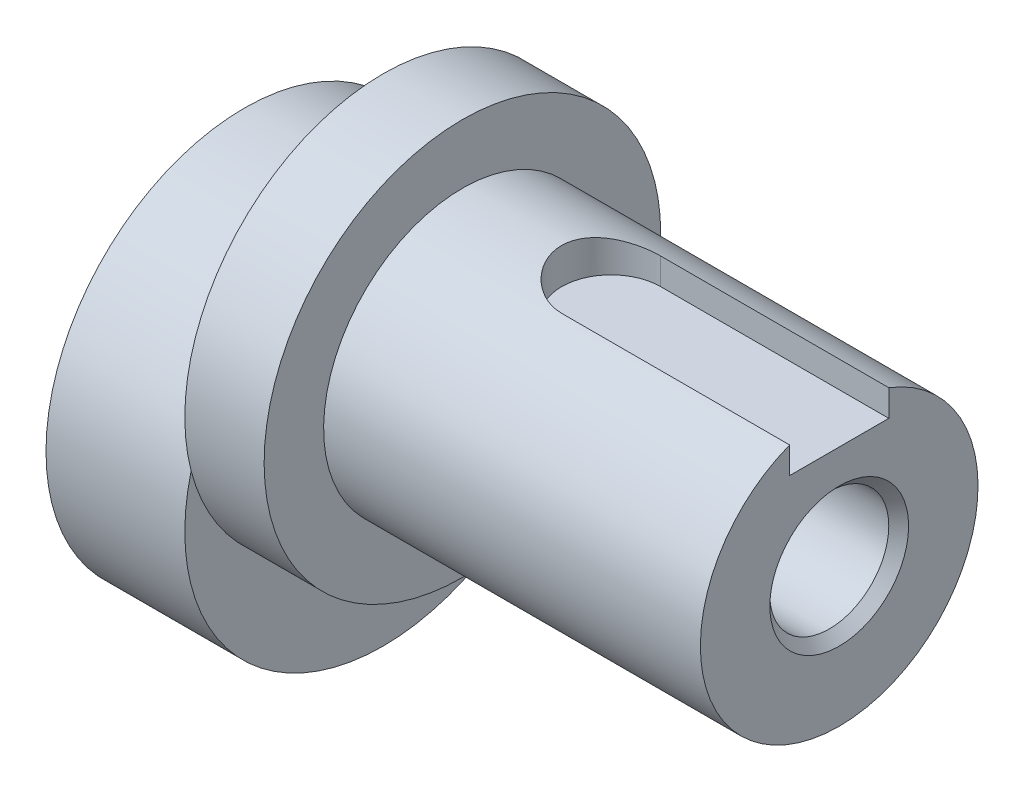
ISO-10303-21;
HEADER;
FILE_DESCRIPTION(('STEP AP214'),'2;1');
FILE_NAME('part.step','',(''),(''),'','','');
FILE_SCHEMA(('AUTOMOTIVE_DESIGN { 1 0 10303 214 1 1 1 1 }'));
ENDSEC;
DATA;
#1=APPLICATION_CONTEXT('core data for automotive mechanical design processes');
#2=APPLICATION_PROTOCOL_DEFINITION('international standard','automotive_design',2000,#1);
#3=PRODUCT_CONTEXT('',#1,'mechanical');
#4=PRODUCT('Part','Part','',(#3));
#5=PRODUCT_RELATED_PRODUCT_CATEGORY('part','',(#4));
#6=PRODUCT_DEFINITION_FORMATION('','',#4);
#7=PRODUCT_DEFINITION_CONTEXT('part definition',#1,'design');
#8=PRODUCT_DEFINITION('design','',#6,#7);
#9=PRODUCT_DEFINITION_SHAPE('','',#8);
#10=(LENGTH_UNIT() NAMED_UNIT(*) SI_UNIT(.MILLI.,.METRE.));
#11=(NAMED_UNIT(*) PLANE_ANGLE_UNIT() SI_UNIT($,.RADIAN.));
#12=(NAMED_UNIT(*) SI_UNIT($,.STERADIAN.) SOLID_ANGLE_UNIT());
#13=UNCERTAINTY_MEASURE_WITH_UNIT(LENGTH_MEASURE(1.E-05),#10,'distance_accuracy_value','');
#14=(GEOMETRIC_REPRESENTATION_CONTEXT(3) GLOBAL_UNCERTAINTY_ASSIGNED_CONTEXT((#13)) GLOBAL_UNIT_ASSIGNED_CONTEXT((#10,
#11,#12)) REPRESENTATION_CONTEXT('',''));
#15=CARTESIAN_POINT('',(0.,0.,0.));
#16=DIRECTION('',(0.,0.,1.));
#17=DIRECTION('',(1.,0.,0.));
#18=AXIS2_PLACEMENT_3D('',#15,#16,#17);
#19=CARTESIAN_POINT('',(30.,5.,0.));
#20=DIRECTION('',(-1.,0.,0.));
#21=DIRECTION('',(0.,0.,1.));
#22=AXIS2_PLACEMENT_3D('',#19,#20,#21);
#23=CYLINDRICAL_SURFACE('',#22,7.);
#24=CARTESIAN_POINT('',(11.,5.,0.));
#25=DIRECTION('',(1.,0.,0.));
#26=DIRECTION('',(0.,0.,-1.));
#27=AXIS2_PLACEMENT_3D('',#24,#25,#26);
#28=CIRCLE('',#27,7.);
#29=CARTESIAN_POINT('',(11.,5.,-7.));
#30=VERTEX_POINT('',#29);
#31=EDGE_CURVE('E132',#30,#30,#28,.T.);
#32=ORIENTED_EDGE('',*,*,#31,.T.);
#33=EDGE_LOOP('',(#32));
#34=FACE_BOUND('',#33,.T.);
#35=DIRECTION('',(-1.,0.,0.));
#36=VECTOR('',#35,1.);
#37=CARTESIAN_POINT('',(30.,11.538348415311,-2.5));
#38=LINE('',#37,#36);
#39=CARTESIAN_POINT('',(30.,11.538348415311,-2.5));
#40=VERTEX_POINT('',#39);
#41=CARTESIAN_POINT('',(18.5,11.538348415311,-2.5));
#42=VERTEX_POINT('',#41);
#43=EDGE_CURVE('E100',#40,#42,#38,.T.);
#44=ORIENTED_EDGE('',*,*,#43,.F.);
#45=CARTESIAN_POINT('',(30.,5.,0.));
#46=DIRECTION('',(1.,0.,0.));
#47=DIRECTION('',(0.,0.,-1.));
#48=AXIS2_PLACEMENT_3D('',#45,#46,#47);
#49=CIRCLE('',#48,7.);
#50=CARTESIAN_POINT('',(30.,11.538348415311,2.5));
#51=VERTEX_POINT('',#50);
#52=EDGE_CURVE('E127',#51,#40,#49,.T.);
#53=ORIENTED_EDGE('',*,*,#52,.F.);
#54=DIRECTION('',(-1.,0.,0.));
#55=VECTOR('',#54,1.);
#56=CARTESIAN_POINT('',(30.,11.538348415311,2.5));
#57=LINE('',#56,#55);
#58=CARTESIAN_POINT('',(18.5,11.538348415311,2.5));
#59=VERTEX_POINT('',#58);
#60=EDGE_CURVE('E105',#59,#51,#57,.F.);
#61=ORIENTED_EDGE('',*,*,#60,.F.);
#62=CARTESIAN_POINT('',(18.5,11.538348415311,-2.5));
#63=CARTESIAN_POINT('',(18.4321107542711,11.5383365378513,-2.50000932220903));
#64=CARTESIAN_POINT('',(18.3642280673609,11.5394054992274,-2.49723485076694));
#65=CARTESIAN_POINT('',(18.2289960893886,11.5436165747813,-2.4861910211816));
#66=CARTESIAN_POINT('',(18.1616466413939,11.5467580541806,-2.47792334551208));
#67=CARTESIAN_POINT('',(18.0281785853972,11.5550121763794,-2.456001752859));
#68=CARTESIAN_POINT('',(17.9620566636602,11.5601183170568,-2.44236559963955));
#69=CARTESIAN_POINT('',(17.8312981648915,11.5721317785417,-2.40985115466648));
#70=CARTESIAN_POINT('',(17.7666616536876,11.5790391790075,-2.39097263107435));
#71=CARTESIAN_POINT('',(17.5757356335225,11.6021493436571,-2.32673964179204));
#72=CARTESIAN_POINT('',(17.4522095478644,11.6207547534084,-2.27375112606986));
#73=CARTESIAN_POINT('',(17.215769666872,11.6622539736071,-2.14910757865425));
#74=CARTESIAN_POINT('',(17.1028636832645,11.6851509042488,-2.07743895048849));
#75=CARTESIAN_POINT('',(16.8857847866473,11.7337991379222,-1.9140257110197));
#76=CARTESIAN_POINT('',(16.7821535248041,11.7596286404137,-1.82158337146744));
#77=CARTESIAN_POINT('',(16.5914912952836,11.8105759232303,-1.6207338877633));
#78=CARTESIAN_POINT('',(16.5044634207566,11.8356935701987,-1.51232377552673));
#79=CARTESIAN_POINT('',(16.346910144545,11.8833113327905,-1.27853915335934));
#80=CARTESIAN_POINT('',(16.2769684781395,11.905708352238,-1.15274833789185));
#81=CARTESIAN_POINT('',(16.1594633532026,11.9444235767263,-0.890250825476634));
#82=CARTESIAN_POINT('',(16.111892220954,11.9607438658547,-0.753547890540326));
#83=CARTESIAN_POINT('',(16.0423593978176,11.9849105051071,-0.478829979256174));
#84=CARTESIAN_POINT('',(16.0194608695289,11.9930659435251,-0.341079835227466));
#85=CARTESIAN_POINT('',(15.9969315972223,12.0010879805382,-0.0634643052969036));
#86=CARTESIAN_POINT('',(15.9972944139653,12.000956873027,0.0764004845074482));
#87=CARTESIAN_POINT('',(16.0207112737611,11.9926225804908,0.347593258486945));
#88=CARTESIAN_POINT('',(16.0427447941985,11.9847824358352,0.47902240707872));
#89=CARTESIAN_POINT('',(16.1071734241588,11.9623783250735,0.736175812143607));
#90=CARTESIAN_POINT('',(16.1495696843625,11.9478139789904,0.861899745780464));
#91=CARTESIAN_POINT('',(16.2540469115653,11.9131650689037,1.10616102429807));
#92=CARTESIAN_POINT('',(16.3163957149601,11.8930059216431,1.22457279066906));
#93=CARTESIAN_POINT('',(16.4587793352234,11.8492335561632,1.44953531305523));
#94=CARTESIAN_POINT('',(16.5388195237836,11.8256192895926,1.5560824517677));
#95=CARTESIAN_POINT('',(16.7193232636567,11.7759054780549,1.7603244525607));
#96=CARTESIAN_POINT('',(16.8206497231449,11.7497405584388,1.85724185700417));
#97=CARTESIAN_POINT('',(17.0383273641656,11.6989034246898,2.03299914621296));
#98=CARTESIAN_POINT('',(17.1546839051685,11.6742317476526,2.11183255456462));
#99=CARTESIAN_POINT('',(17.401942598522,11.628778038754,2.25049860898459));
#100=CARTESIAN_POINT('',(17.5330789755054,11.6080787511899,2.30994207989625));
#101=CARTESIAN_POINT('',(17.8043648015822,11.5738821361027,2.4055543972585));
#102=CARTESIAN_POINT('',(17.944499141169,11.5603730716505,2.44176119399954));
#103=CARTESIAN_POINT('',(18.1550305442642,11.5470854224556,2.47705497148627));
#104=CARTESIAN_POINT('',(18.2237363017718,11.5438201096791,2.48565347586445));
#105=CARTESIAN_POINT('',(18.3616151641917,11.5394491082968,2.49712352174882));
#106=CARTESIAN_POINT('',(18.4307876671005,11.5383410314093,2.50000139665367));
#107=CARTESIAN_POINT('',(18.5,11.538348415311,2.5));
#108=B_SPLINE_CURVE_WITH_KNOTS('',3,(#62,#63,#64,#65,#66,#67,#68,#69,#70,#71,#72,#73,#74,#75,
#76,#77,#78,#79,#80,#81,#82,#83,#84,#85,#86,#87,#88,#89,#90,#91,#92,#93,#94,#95,#96,#97,#98,#99,
#100,#101,#102,#103,#104,#105,#106,#107),.UNSPECIFIED.,.F.,.F.,(4,2,2,2,2,2,2,2,2,2,2,2,2,2,2,2,
2,2,2,2,2,2,4),(0.,0.203591628551589,0.407120929225528,0.609982356545741,0.812852756635989,
1.21793118555512,1.6233052814847,2.0451597231193,2.4670926781184,2.90188398965561,
3.33652604665238,3.75400993940861,4.17137826416922,4.56998920861347,4.96862268086888,
5.37284909448639,5.77719841367921,6.20315837945087,6.6292706567472,7.06347329058504,
7.49696496492444,7.70468580162772,7.91217653896403),.UNSPECIFIED.);
#109=EDGE_CURVE('E11',#42,#59,#108,.T.);
#110=ORIENTED_EDGE('',*,*,#109,.F.);
#111=EDGE_LOOP('',(#44,#53,#61,#110));
#112=FACE_BOUND('',#111,.T.);
#113=ADVANCED_FACE('F39',(#34,#112),#23,.T.);
#114=CARTESIAN_POINT('',(30.,5.,0.));
#115=DIRECTION('',(1.,0.,0.));
#116=DIRECTION('',(0.,0.,-1.));
#117=AXIS2_PLACEMENT_3D('',#114,#115,#116);
#118=PLANE('',#117);
#119=CARTESIAN_POINT('',(30.,5.,0.));
#120=DIRECTION('',(1.,0.,0.));
#121=DIRECTION('',(0.,0.,-1.));
#122=AXIS2_PLACEMENT_3D('',#119,#120,#121);
#123=CIRCLE('',#122,3.50000000000002);
#124=CARTESIAN_POINT('',(30.,5.,-3.50000000000002));
#125=VERTEX_POINT('',#124);
#126=EDGE_CURVE('E159',#125,#125,#123,.F.);
#127=ORIENTED_EDGE('',*,*,#126,.T.);
#128=EDGE_LOOP('',(#127));
#129=FACE_BOUND('',#128,.T.);
#130=ORIENTED_EDGE('',*,*,#52,.T.);
#131=DIRECTION('',(0.,-1.,0.));
#132=VECTOR('',#131,1.);
#133=CARTESIAN_POINT('',(30.,5.,-2.5));
#134=LINE('',#133,#132);
#135=CARTESIAN_POINT('',(30.,10.2,-2.5));
#136=VERTEX_POINT('',#135);
#137=EDGE_CURVE('E54',#40,#136,#134,.T.);
#138=ORIENTED_EDGE('',*,*,#137,.T.);
#139=DIRECTION('',(0.,0.,1.));
#140=VECTOR('',#139,1.);
#141=CARTESIAN_POINT('',(30.,10.2,0.));
#142=LINE('',#141,#140);
#143=CARTESIAN_POINT('',(30.,10.2,2.5));
#144=VERTEX_POINT('',#143);
#145=EDGE_CURVE('E111',#136,#144,#142,.T.);
#146=ORIENTED_EDGE('',*,*,#145,.T.);
#147=DIRECTION('',(0.,1.,0.));
#148=VECTOR('',#147,1.);
#149=CARTESIAN_POINT('',(30.,5.,2.5));
#150=LINE('',#149,#148);
#151=EDGE_CURVE('E169',#144,#51,#150,.T.);
#152=ORIENTED_EDGE('',*,*,#151,.T.);
#153=EDGE_LOOP('',(#130,#138,#146,#152));
#154=FACE_BOUND('',#153,.T.);
#155=ADVANCED_FACE('F174',(#129,#154),#118,.T.);
#156=CARTESIAN_POINT('',(7.,0.,0.));
#157=DIRECTION('',(-1.,0.,0.));
#158=DIRECTION('',(0.,0.,1.));
#159=AXIS2_PLACEMENT_3D('',#156,#157,#158);
#160=CYLINDRICAL_SURFACE('',#159,10.);
#161=CARTESIAN_POINT('',(7.,0.,0.));
#162=DIRECTION('',(1.,0.,0.));
#163=DIRECTION('',(0.,0.,-1.));
#164=AXIS2_PLACEMENT_3D('',#161,#162,#163);
#165=CIRCLE('',#164,10.);
#166=CARTESIAN_POINT('',(7.,2.49999999999999,-9.68245836551854));
#167=VERTEX_POINT('',#166);
#168=CARTESIAN_POINT('',(7.,2.49999999999999,9.68245836551854));
#169=VERTEX_POINT('',#168);
#170=EDGE_CURVE('E137',#167,#169,#165,.T.);
#171=ORIENTED_EDGE('',*,*,#170,.F.);
#172=EDGE_CURVE('E148',#169,#167,#165,.T.);
#173=ORIENTED_EDGE('',*,*,#172,.F.);
#174=EDGE_LOOP('',(#171,#173));
#175=FACE_BOUND('',#174,.T.);
#176=CARTESIAN_POINT('',(0.,0.,0.));
#177=DIRECTION('',(1.,0.,0.));
#178=DIRECTION('',(0.,0.,-1.));
#179=AXIS2_PLACEMENT_3D('',#176,#177,#178);
#180=CIRCLE('',#179,10.);
#181=CARTESIAN_POINT('',(0.,0.,-10.));
#182=VERTEX_POINT('',#181);
#183=EDGE_CURVE('E142',#182,#182,#180,.T.);
#184=ORIENTED_EDGE('',*,*,#183,.T.);
#185=EDGE_LOOP('',(#184));
#186=FACE_BOUND('',#185,.T.);
#187=ADVANCED_FACE('F193',(#175,#186),#160,.T.);
#188=CARTESIAN_POINT('',(7.,0.,0.));
#189=DIRECTION('',(1.,0.,0.));
#190=DIRECTION('',(0.,0.,-1.));
#191=AXIS2_PLACEMENT_3D('',#188,#189,#190);
#192=PLANE('',#191);
#193=CARTESIAN_POINT('',(7.,5.,0.));
#194=DIRECTION('',(1.,0.,0.));
#195=DIRECTION('',(0.,0.,-1.));
#196=AXIS2_PLACEMENT_3D('',#193,#194,#195);
#197=CIRCLE('',#196,10.);
#198=EDGE_CURVE('E68',#169,#167,#197,.T.);
#199=ORIENTED_EDGE('',*,*,#198,.F.);
#200=ORIENTED_EDGE('',*,*,#172,.T.);
#201=EDGE_LOOP('',(#199,#200));
#202=FACE_BOUND('',#201,.T.);
#203=ADVANCED_FACE('F213',(#202),#192,.T.);
#204=CARTESIAN_POINT('',(0.,0.,0.));
#205=DIRECTION('',(1.,0.,0.));
#206=DIRECTION('',(0.,0.,-1.));
#207=AXIS2_PLACEMENT_3D('',#204,#205,#206);
#208=PLANE('',#207);
#209=CARTESIAN_POINT('',(0.,5.,0.));
#210=DIRECTION('',(1.,0.,0.));
#211=DIRECTION('',(0.,0.,-1.));
#212=AXIS2_PLACEMENT_3D('',#209,#210,#211);
#213=CIRCLE('',#212,3.5);
#214=CARTESIAN_POINT('',(0.,5.,-3.5));
#215=VERTEX_POINT('',#214);
#216=EDGE_CURVE('E163',#215,#215,#213,.T.);
#217=ORIENTED_EDGE('',*,*,#216,.T.);
#218=EDGE_LOOP('',(#217));
#219=FACE_BOUND('',#218,.T.);
#220=ORIENTED_EDGE('',*,*,#183,.F.);
#221=EDGE_LOOP('',(#220));
#222=FACE_BOUND('',#221,.T.);
#223=ADVANCED_FACE('F208',(#219,#222),#208,.F.);
#224=CARTESIAN_POINT('',(7.,5.,0.));
#225=DIRECTION('',(1.,0.,0.));
#226=DIRECTION('',(0.,0.,-1.));
#227=AXIS2_PLACEMENT_3D('',#224,#225,#226);
#228=PLANE('',#227);
#229=EDGE_CURVE('E131',#167,#169,#197,.T.);
#230=ORIENTED_EDGE('',*,*,#229,.F.);
#231=ORIENTED_EDGE('',*,*,#170,.T.);
#232=EDGE_LOOP('',(#230,#231));
#233=FACE_BOUND('',#232,.T.);
#234=ADVANCED_FACE('F205',(#233),#228,.F.);
#235=CARTESIAN_POINT('',(11.,5.,0.));
#236=DIRECTION('',(-1.,0.,0.));
#237=DIRECTION('',(0.,0.,1.));
#238=AXIS2_PLACEMENT_3D('',#235,#236,#237);
#239=CYLINDRICAL_SURFACE('',#238,10.);
#240=CARTESIAN_POINT('',(11.,5.,0.));
#241=DIRECTION('',(1.,0.,0.));
#242=DIRECTION('',(0.,0.,-1.));
#243=AXIS2_PLACEMENT_3D('',#240,#241,#242);
#244=CIRCLE('',#243,10.);
#245=CARTESIAN_POINT('',(11.,5.,-10.));
#246=VERTEX_POINT('',#245);
#247=EDGE_CURVE('E138',#246,#246,#244,.T.);
#248=ORIENTED_EDGE('',*,*,#247,.F.);
#249=EDGE_LOOP('',(#248));
#250=FACE_BOUND('',#249,.T.);
#251=ORIENTED_EDGE('',*,*,#198,.T.);
#252=ORIENTED_EDGE('',*,*,#229,.T.);
#253=EDGE_LOOP('',(#251,#252));
#254=FACE_BOUND('',#253,.T.);
#255=ADVANCED_FACE('F203',(#250,#254),#239,.T.);
#256=CARTESIAN_POINT('',(11.,5.,0.));
#257=DIRECTION('',(1.,0.,0.));
#258=DIRECTION('',(0.,0.,-1.));
#259=AXIS2_PLACEMENT_3D('',#256,#257,#258);
#260=PLANE('',#259);
#261=ORIENTED_EDGE('',*,*,#31,.F.);
#262=EDGE_LOOP('',(#261));
#263=FACE_BOUND('',#262,.T.);
#264=ORIENTED_EDGE('',*,*,#247,.T.);
#265=EDGE_LOOP('',(#264));
#266=FACE_BOUND('',#265,.T.);
#267=ADVANCED_FACE('F199',(#263,#266),#260,.T.);
#268=CARTESIAN_POINT('',(0.,5.,0.));
#269=DIRECTION('',(1.,0.,0.));
#270=DIRECTION('',(0.,0.,-1.));
#271=AXIS2_PLACEMENT_3D('',#268,#269,#270);
#272=CYLINDRICAL_SURFACE('',#271,3.);
#273=CARTESIAN_POINT('',(29.5,5.,0.));
#274=DIRECTION('',(1.,0.,0.));
#275=DIRECTION('',(0.,0.,-1.));
#276=AXIS2_PLACEMENT_3D('',#273,#274,#275);
#277=CIRCLE('',#276,3.);
#278=CARTESIAN_POINT('',(29.5,5.,-3.));
#279=VERTEX_POINT('',#278);
#280=EDGE_CURVE('E155',#279,#279,#277,.T.);
#281=ORIENTED_EDGE('',*,*,#280,.T.);
#282=EDGE_LOOP('',(#281));
#283=FACE_BOUND('',#282,.T.);
#284=CARTESIAN_POINT('',(0.500000000000003,5.,0.));
#285=DIRECTION('',(1.,0.,0.));
#286=DIRECTION('',(0.,0.,-1.));
#287=AXIS2_PLACEMENT_3D('',#284,#285,#286);
#288=CIRCLE('',#287,3.);
#289=CARTESIAN_POINT('',(0.500000000000003,5.,-3.));
#290=VERTEX_POINT('',#289);
#291=EDGE_CURVE('E136',#290,#290,#288,.F.);
#292=ORIENTED_EDGE('',*,*,#291,.T.);
#293=EDGE_LOOP('',(#292));
#294=FACE_BOUND('',#293,.T.);
#295=ADVANCED_FACE('F202',(#283,#294),#272,.F.);
#296=CARTESIAN_POINT('',(29.5,5.,0.));
#297=DIRECTION('',(1.,0.,0.));
#298=DIRECTION('',(0.,0.,-1.));
#299=AXIS2_PLACEMENT_3D('',#296,#297,#298);
#300=CONICAL_SURFACE('',#299,3.,0.785398163397451);
#301=ORIENTED_EDGE('',*,*,#126,.F.);
#302=EDGE_LOOP('',(#301));
#303=FACE_BOUND('',#302,.T.);
#304=ORIENTED_EDGE('',*,*,#280,.F.);
#305=EDGE_LOOP('',(#304));
#306=FACE_BOUND('',#305,.T.);
#307=ADVANCED_FACE('F221',(#303,#306),#300,.F.);
#308=CARTESIAN_POINT('',(0.,5.,0.));
#309=DIRECTION('',(-1.,0.,0.));
#310=DIRECTION('',(0.,0.,1.));
#311=AXIS2_PLACEMENT_3D('',#308,#309,#310);
#312=CONICAL_SURFACE('',#311,3.5,0.785398163397445);
#313=ORIENTED_EDGE('',*,*,#291,.F.);
#314=EDGE_LOOP('',(#313));
#315=FACE_BOUND('',#314,.T.);
#316=ORIENTED_EDGE('',*,*,#216,.F.);
#317=EDGE_LOOP('',(#316));
#318=FACE_BOUND('',#317,.T.);
#319=ADVANCED_FACE('F41',(#315,#318),#312,.F.);
#320=CARTESIAN_POINT('',(18.5,15.,0.));
#321=DIRECTION('',(0.,-1.,0.));
#322=DIRECTION('',(0.,0.,-1.));
#323=AXIS2_PLACEMENT_3D('',#320,#321,#322);
#324=CYLINDRICAL_SURFACE('',#323,2.5);
#325=ORIENTED_EDGE('',*,*,#109,.T.);
#326=DIRECTION('',(0.,-1.,0.));
#327=VECTOR('',#326,1.);
#328=CARTESIAN_POINT('',(18.5,15.,2.5));
#329=LINE('',#328,#327);
#330=CARTESIAN_POINT('',(18.5,10.2,2.5));
#331=VERTEX_POINT('',#330);
#332=EDGE_CURVE('E106',#59,#331,#329,.T.);
#333=ORIENTED_EDGE('',*,*,#332,.T.);
#334=CARTESIAN_POINT('',(18.5,10.2,0.));
#335=DIRECTION('',(0.,1.,0.));
#336=DIRECTION('',(0.,0.,1.));
#337=AXIS2_PLACEMENT_3D('',#334,#335,#336);
#338=CIRCLE('',#337,2.5);
#339=CARTESIAN_POINT('',(18.5,10.2,-2.5));
#340=VERTEX_POINT('',#339);
#341=EDGE_CURVE('E109',#340,#331,#338,.T.);
#342=ORIENTED_EDGE('',*,*,#341,.F.);
#343=DIRECTION('',(0.,-1.,0.));
#344=VECTOR('',#343,1.);
#345=CARTESIAN_POINT('',(18.5,15.,-2.5));
#346=LINE('',#345,#344);
#347=EDGE_CURVE('E94',#42,#340,#346,.T.);
#348=ORIENTED_EDGE('',*,*,#347,.F.);
#349=EDGE_LOOP('',(#325,#333,#342,#348));
#350=FACE_BOUND('',#349,.T.);
#351=ADVANCED_FACE('F114',(#350),#324,.F.);
#352=CARTESIAN_POINT('',(31.,15.,-2.5));
#353=DIRECTION('',(0.,0.,1.));
#354=DIRECTION('',(1.,0.,0.));
#355=AXIS2_PLACEMENT_3D('',#352,#353,#354);
#356=PLANE('',#355);
#357=ORIENTED_EDGE('',*,*,#43,.T.);
#358=ORIENTED_EDGE('',*,*,#347,.T.);
#359=DIRECTION('',(-1.,0.,0.));
#360=VECTOR('',#359,1.);
#361=CARTESIAN_POINT('',(31.,10.2,-2.5));
#362=LINE('',#361,#360);
#363=EDGE_CURVE('E97',#136,#340,#362,.T.);
#364=ORIENTED_EDGE('',*,*,#363,.F.);
#365=ORIENTED_EDGE('',*,*,#137,.F.);
#366=EDGE_LOOP('',(#357,#358,#364,#365));
#367=FACE_BOUND('',#366,.T.);
#368=ADVANCED_FACE('F96',(#367),#356,.T.);
#369=CARTESIAN_POINT('',(31.,15.,2.5));
#370=DIRECTION('',(0.,0.,-1.));
#371=DIRECTION('',(-1.,0.,0.));
#372=AXIS2_PLACEMENT_3D('',#369,#370,#371);
#373=PLANE('',#372);
#374=ORIENTED_EDGE('',*,*,#60,.T.);
#375=ORIENTED_EDGE('',*,*,#151,.F.);
#376=DIRECTION('',(1.,0.,0.));
#377=VECTOR('',#376,1.);
#378=CARTESIAN_POINT('',(31.,10.2,2.5));
#379=LINE('',#378,#377);
#380=EDGE_CURVE('E61',#331,#144,#379,.T.);
#381=ORIENTED_EDGE('',*,*,#380,.F.);
#382=ORIENTED_EDGE('',*,*,#332,.F.);
#383=EDGE_LOOP('',(#374,#375,#381,#382));
#384=FACE_BOUND('',#383,.T.);
#385=ADVANCED_FACE('F179',(#384),#373,.T.);
#386=CARTESIAN_POINT('',(18.5,10.2,0.));
#387=DIRECTION('',(0.,1.,0.));
#388=DIRECTION('',(0.,0.,1.));
#389=AXIS2_PLACEMENT_3D('',#386,#387,#388);
#390=PLANE('',#389);
#391=ORIENTED_EDGE('',*,*,#363,.T.);
#392=ORIENTED_EDGE('',*,*,#341,.T.);
#393=ORIENTED_EDGE('',*,*,#380,.T.);
#394=ORIENTED_EDGE('',*,*,#145,.F.);
#395=EDGE_LOOP('',(#391,#392,#393,#394));
#396=FACE_BOUND('',#395,.T.);
#397=ADVANCED_FACE('F108',(#396),#390,.T.);
#398=CLOSED_SHELL('',(#113,#155,#187,#203,#223,#234,#255,#267,#295,#307,#319,#351,#368,#385,#397));
#399=MANIFOLD_SOLID_BREP('B2',#398);
#400=ADVANCED_BREP_SHAPE_REPRESENTATION('',(#18,#399),#14);
#401=SHAPE_DEFINITION_REPRESENTATION(#9,#400);
ENDSEC;
END-ISO-10303-21;
